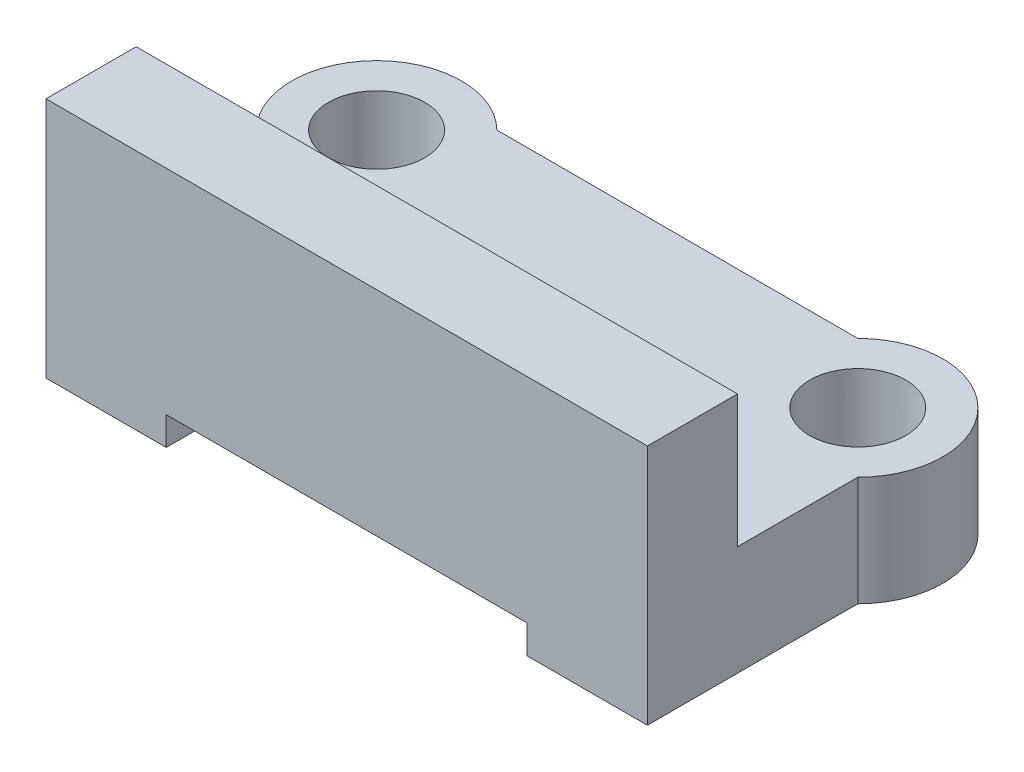
ISO-10303-21;
HEADER;
FILE_DESCRIPTION(('STEP AP214'),'2;1');
FILE_NAME('part.step','',(''),(''),'','','');
FILE_SCHEMA(('AUTOMOTIVE_DESIGN { 1 0 10303 214 1 1 1 1 }'));
ENDSEC;
DATA;
#1=APPLICATION_CONTEXT('core data for automotive mechanical design processes');
#2=APPLICATION_PROTOCOL_DEFINITION('international standard','automotive_design',2000,#1);
#3=PRODUCT_CONTEXT('',#1,'mechanical');
#4=PRODUCT('Part','Part','',(#3));
#5=PRODUCT_RELATED_PRODUCT_CATEGORY('part','',(#4));
#6=PRODUCT_DEFINITION_FORMATION('','',#4);
#7=PRODUCT_DEFINITION_CONTEXT('part definition',#1,'design');
#8=PRODUCT_DEFINITION('design','',#6,#7);
#9=PRODUCT_DEFINITION_SHAPE('','',#8);
#10=(LENGTH_UNIT() NAMED_UNIT(*) SI_UNIT(.MILLI.,.METRE.));
#11=(NAMED_UNIT(*) PLANE_ANGLE_UNIT() SI_UNIT($,.RADIAN.));
#12=(NAMED_UNIT(*) SI_UNIT($,.STERADIAN.) SOLID_ANGLE_UNIT());
#13=UNCERTAINTY_MEASURE_WITH_UNIT(LENGTH_MEASURE(1.E-05),#10,'distance_accuracy_value','');
#14=(GEOMETRIC_REPRESENTATION_CONTEXT(3) GLOBAL_UNCERTAINTY_ASSIGNED_CONTEXT((#13)) GLOBAL_UNIT_ASSIGNED_CONTEXT((#10,
#11,#12)) REPRESENTATION_CONTEXT('',''));
#15=CARTESIAN_POINT('',(0.,0.,0.));
#16=DIRECTION('',(0.,0.,1.));
#17=DIRECTION('',(1.,0.,0.));
#18=AXIS2_PLACEMENT_3D('',#15,#16,#17);
#19=CARTESIAN_POINT('',(0.,0.,0.));
#20=DIRECTION('',(0.,0.,1.));
#21=DIRECTION('',(1.,0.,0.));
#22=AXIS2_PLACEMENT_3D('',#19,#20,#21);
#23=PLANE('',#22);
#24=DIRECTION('',(1.,0.,0.));
#25=VECTOR('',#24,1.);
#26=CARTESIAN_POINT('',(40.6261390455604,-82.2027077511568,0.));
#27=LINE('',#26,#25);
#28=CARTESIAN_POINT('',(20.6185390455604,-82.2027077511568,0.));
#29=VERTEX_POINT('',#28);
#30=CARTESIAN_POINT('',(40.6261390455604,-82.2027077511568,0.));
#31=VERTEX_POINT('',#30);
#32=EDGE_CURVE('E185',#29,#31,#27,.T.);
#33=ORIENTED_EDGE('',*,*,#32,.F.);
#34=DIRECTION('',(0.,-1.,0.));
#35=VECTOR('',#34,1.);
#36=CARTESIAN_POINT('',(20.6185390455604,-73.2027077643161,0.));
#37=LINE('',#36,#35);
#38=CARTESIAN_POINT('',(20.6185390455604,-77.8027077487986,0.));
#39=VERTEX_POINT('',#38);
#40=EDGE_CURVE('E143',#39,#29,#37,.T.);
#41=ORIENTED_EDGE('',*,*,#40,.F.);
#42=DIRECTION('',(1.,0.,0.));
#43=VECTOR('',#42,1.);
#44=CARTESIAN_POINT('',(12.1261390455604,-77.8027077511569,0.));
#45=LINE('',#44,#43);
#46=CARTESIAN_POINT('',(40.6261390455604,-77.8027077487986,0.));
#47=VERTEX_POINT('',#46);
#48=EDGE_CURVE('E207',#39,#47,#45,.T.);
#49=ORIENTED_EDGE('',*,*,#48,.T.);
#50=DIRECTION('',(0.,1.,0.));
#51=VECTOR('',#50,1.);
#52=CARTESIAN_POINT('',(40.6261390455604,-85.8498182715212,0.));
#53=LINE('',#52,#51);
#54=EDGE_CURVE('E38',#31,#47,#53,.T.);
#55=ORIENTED_EDGE('',*,*,#54,.F.);
#56=EDGE_LOOP('',(#33,#41,#49,#55));
#57=FACE_BOUND('',#56,.T.);
#58=ADVANCED_FACE('F34',(#57),#23,.F.);
#59=CARTESIAN_POINT('',(36.6261390455604,-85.8498182715212,3.));
#60=DIRECTION('',(0.,1.,0.));
#61=DIRECTION('',(0.,0.,1.));
#62=AXIS2_PLACEMENT_3D('',#59,#60,#61);
#63=PLANE('',#62);
#64=CARTESIAN_POINT('',(38.6261390455604,-85.8498182715212,-6.00000000000001));
#65=DIRECTION('',(0.,1.,0.));
#66=DIRECTION('',(0.,0.,1.));
#67=AXIS2_PLACEMENT_3D('',#64,#65,#66);
#68=CIRCLE('',#67,1.6);
#69=CARTESIAN_POINT('',(38.6261390455604,-85.8498182715212,-4.40000000000001));
#70=VERTEX_POINT('',#69);
#71=EDGE_CURVE('E218',#70,#70,#68,.T.);
#72=ORIENTED_EDGE('',*,*,#71,.T.);
#73=EDGE_LOOP('',(#72));
#74=FACE_BOUND('',#73,.T.);
#75=DIRECTION('',(0.,0.,-1.));
#76=VECTOR('',#75,1.);
#77=CARTESIAN_POINT('',(36.6261390455604,-85.8498182715212,3.));
#78=LINE('',#77,#76);
#79=CARTESIAN_POINT('',(36.6261390455604,-85.8498182715212,3.));
#80=VERTEX_POINT('',#79);
#81=CARTESIAN_POINT('',(36.6261390455604,-85.8498182715212,-8.));
#82=VERTEX_POINT('',#81);
#83=EDGE_CURVE('E153',#80,#82,#78,.T.);
#84=ORIENTED_EDGE('',*,*,#83,.T.);
#85=CARTESIAN_POINT('',(38.6261390455604,-85.8498182715212,-6.00000000000001));
#86=DIRECTION('',(0.,-1.,0.));
#87=DIRECTION('',(0.,0.,-1.));
#88=AXIS2_PLACEMENT_3D('',#85,#86,#87);
#89=CIRCLE('',#88,2.82842712474619);
#90=CARTESIAN_POINT('',(40.6261390455604,-85.8498182715212,-4.00000000000001));
#91=VERTEX_POINT('',#90);
#92=EDGE_CURVE('E177',#82,#91,#89,.T.);
#93=ORIENTED_EDGE('',*,*,#92,.T.);
#94=DIRECTION('',(0.,0.,-1.));
#95=VECTOR('',#94,1.);
#96=CARTESIAN_POINT('',(40.6261390455604,-85.8498182715212,3.));
#97=LINE('',#96,#95);
#98=CARTESIAN_POINT('',(40.6261390455604,-85.8498182715212,3.));
#99=VERTEX_POINT('',#98);
#100=EDGE_CURVE('E11',#99,#91,#97,.T.);
#101=ORIENTED_EDGE('',*,*,#100,.F.);
#102=DIRECTION('',(1.,0.,0.));
#103=VECTOR('',#102,1.);
#104=CARTESIAN_POINT('',(36.6261390455604,-85.8498182715212,3.));
#105=LINE('',#104,#103);
#106=EDGE_CURVE('E137',#80,#99,#105,.T.);
#107=ORIENTED_EDGE('',*,*,#106,.F.);
#108=EDGE_LOOP('',(#84,#93,#101,#107));
#109=FACE_BOUND('',#108,.T.);
#110=ADVANCED_FACE('F36',(#74,#109),#63,.F.);
#111=CARTESIAN_POINT('',(40.6261390455604,-85.8498182715212,3.));
#112=DIRECTION('',(-1.,0.,0.));
#113=DIRECTION('',(0.,0.,1.));
#114=AXIS2_PLACEMENT_3D('',#111,#112,#113);
#115=PLANE('',#114);
#116=ORIENTED_EDGE('',*,*,#54,.T.);
#117=DIRECTION('',(0.,0.,1.));
#118=VECTOR('',#117,1.);
#119=CARTESIAN_POINT('',(40.6261390455604,-77.8027077487986,3.));
#120=LINE('',#119,#118);
#121=CARTESIAN_POINT('',(40.6261390455604,-77.8027077487986,3.));
#122=VERTEX_POINT('',#121);
#123=EDGE_CURVE('E121',#47,#122,#120,.T.);
#124=ORIENTED_EDGE('',*,*,#123,.T.);
#125=DIRECTION('',(0.,1.,0.));
#126=VECTOR('',#125,1.);
#127=CARTESIAN_POINT('',(40.6261390455604,-85.8498182715212,3.));
#128=LINE('',#127,#126);
#129=EDGE_CURVE('E129',#99,#122,#128,.T.);
#130=ORIENTED_EDGE('',*,*,#129,.F.);
#131=ORIENTED_EDGE('',*,*,#100,.T.);
#132=DIRECTION('',(0.,-1.,0.));
#133=VECTOR('',#132,1.);
#134=CARTESIAN_POINT('',(40.6261390455604,-78.1178220121165,-4.00000000000001));
#135=LINE('',#134,#133);
#136=CARTESIAN_POINT('',(40.6261390455604,-82.2027077511568,-4.00000000000001));
#137=VERTEX_POINT('',#136);
#138=EDGE_CURVE('E133',#137,#91,#135,.T.);
#139=ORIENTED_EDGE('',*,*,#138,.F.);
#140=DIRECTION('',(0.,0.,1.));
#141=VECTOR('',#140,1.);
#142=CARTESIAN_POINT('',(40.6261390455604,-82.2027077511568,-8.));
#143=LINE('',#142,#141);
#144=EDGE_CURVE('E227',#137,#31,#143,.T.);
#145=ORIENTED_EDGE('',*,*,#144,.T.);
#146=EDGE_LOOP('',(#116,#124,#130,#131,#139,#145));
#147=FACE_BOUND('',#146,.T.);
#148=ADVANCED_FACE('F128',(#147),#115,.F.);
#149=CARTESIAN_POINT('',(20.6185390455604,-73.2027077643161,3.));
#150=DIRECTION('',(1.,0.,0.));
#151=DIRECTION('',(0.,1.,0.));
#152=AXIS2_PLACEMENT_3D('',#149,#150,#151);
#153=PLANE('',#152);
#154=DIRECTION('',(0.,-1.,0.));
#155=VECTOR('',#154,1.);
#156=CARTESIAN_POINT('',(20.6185390455604,-73.2027077643161,3.));
#157=LINE('',#156,#155);
#158=CARTESIAN_POINT('',(20.6185390455604,-77.8027077487986,3.));
#159=VERTEX_POINT('',#158);
#160=CARTESIAN_POINT('',(20.6185390455604,-85.8498182715212,3.));
#161=VERTEX_POINT('',#160);
#162=EDGE_CURVE('E139',#159,#161,#157,.T.);
#163=ORIENTED_EDGE('',*,*,#162,.F.);
#164=DIRECTION('',(0.,0.,-1.));
#165=VECTOR('',#164,1.);
#166=CARTESIAN_POINT('',(20.6185390455604,-77.8027077487986,3.));
#167=LINE('',#166,#165);
#168=EDGE_CURVE('E52',#159,#39,#167,.T.);
#169=ORIENTED_EDGE('',*,*,#168,.T.);
#170=ORIENTED_EDGE('',*,*,#40,.T.);
#171=DIRECTION('',(0.,0.,1.));
#172=VECTOR('',#171,1.);
#173=CARTESIAN_POINT('',(20.6185390455604,-82.2027077511568,-8.));
#174=LINE('',#173,#172);
#175=CARTESIAN_POINT('',(20.6185390455604,-82.2027077511568,-4.));
#176=VERTEX_POINT('',#175);
#177=EDGE_CURVE('E230',#176,#29,#174,.T.);
#178=ORIENTED_EDGE('',*,*,#177,.F.);
#179=DIRECTION('',(0.,-1.,0.));
#180=VECTOR('',#179,1.);
#181=CARTESIAN_POINT('',(20.6185390455604,-78.1178220121165,-4.));
#182=LINE('',#181,#180);
#183=CARTESIAN_POINT('',(20.6185390455604,-85.8498182715212,-4.));
#184=VERTEX_POINT('',#183);
#185=EDGE_CURVE('E202',#176,#184,#182,.T.);
#186=ORIENTED_EDGE('',*,*,#185,.T.);
#187=DIRECTION('',(0.,0.,-1.));
#188=VECTOR('',#187,1.);
#189=CARTESIAN_POINT('',(20.6185390455604,-85.8498182715212,3.));
#190=LINE('',#189,#188);
#191=EDGE_CURVE('E44',#161,#184,#190,.T.);
#192=ORIENTED_EDGE('',*,*,#191,.F.);
#193=EDGE_LOOP('',(#163,#169,#170,#178,#186,#192));
#194=FACE_BOUND('',#193,.T.);
#195=ADVANCED_FACE('F240',(#194),#153,.F.);
#196=CARTESIAN_POINT('',(20.6185390455604,-85.8498182715212,3.));
#197=DIRECTION('',(0.,1.,0.));
#198=DIRECTION('',(0.,0.,1.));
#199=AXIS2_PLACEMENT_3D('',#196,#197,#198);
#200=PLANE('',#199);
#201=CARTESIAN_POINT('',(22.6185390455604,-85.8498182715212,-6.));
#202=DIRECTION('',(0.,1.,0.));
#203=DIRECTION('',(0.,0.,1.));
#204=AXIS2_PLACEMENT_3D('',#201,#202,#203);
#205=CIRCLE('',#204,1.6);
#206=CARTESIAN_POINT('',(22.6185390455604,-85.8498182715212,-4.4));
#207=VERTEX_POINT('',#206);
#208=EDGE_CURVE('E212',#207,#207,#205,.T.);
#209=ORIENTED_EDGE('',*,*,#208,.T.);
#210=EDGE_LOOP('',(#209));
#211=FACE_BOUND('',#210,.T.);
#212=ORIENTED_EDGE('',*,*,#191,.T.);
#213=CARTESIAN_POINT('',(22.6185390455604,-85.8498182715212,-6.));
#214=DIRECTION('',(0.,-1.,0.));
#215=DIRECTION('',(0.,0.,-1.));
#216=AXIS2_PLACEMENT_3D('',#213,#214,#215);
#217=CIRCLE('',#216,2.82842712474619);
#218=CARTESIAN_POINT('',(24.6185390455604,-85.8498182715212,-8.));
#219=VERTEX_POINT('',#218);
#220=EDGE_CURVE('E200',#184,#219,#217,.T.);
#221=ORIENTED_EDGE('',*,*,#220,.T.);
#222=DIRECTION('',(0.,0.,-1.));
#223=VECTOR('',#222,1.);
#224=CARTESIAN_POINT('',(24.6185390455604,-85.8498182715212,3.));
#225=LINE('',#224,#223);
#226=CARTESIAN_POINT('',(24.6185390455604,-85.8498182715212,3.));
#227=VERTEX_POINT('',#226);
#228=EDGE_CURVE('E163',#227,#219,#225,.T.);
#229=ORIENTED_EDGE('',*,*,#228,.F.);
#230=DIRECTION('',(1.,0.,0.));
#231=VECTOR('',#230,1.);
#232=CARTESIAN_POINT('',(20.6185390455604,-85.8498182715212,3.));
#233=LINE('',#232,#231);
#234=EDGE_CURVE('E141',#161,#227,#233,.T.);
#235=ORIENTED_EDGE('',*,*,#234,.F.);
#236=EDGE_LOOP('',(#212,#221,#229,#235));
#237=FACE_BOUND('',#236,.T.);
#238=ADVANCED_FACE('F247',(#211,#237),#200,.F.);
#239=CARTESIAN_POINT('',(24.6185390455604,-84.9027077644928,3.));
#240=DIRECTION('',(-1.,0.,0.));
#241=DIRECTION('',(0.,-1.,0.));
#242=AXIS2_PLACEMENT_3D('',#239,#240,#241);
#243=PLANE('',#242);
#244=ORIENTED_EDGE('',*,*,#228,.T.);
#245=DIRECTION('',(0.,-1.,0.));
#246=VECTOR('',#245,1.);
#247=CARTESIAN_POINT('',(24.6185390455604,-84.9027077644928,-8.));
#248=LINE('',#247,#246);
#249=CARTESIAN_POINT('',(24.6185390455604,-84.9027077644928,-8.));
#250=VERTEX_POINT('',#249);
#251=EDGE_CURVE('E223',#250,#219,#248,.T.);
#252=ORIENTED_EDGE('',*,*,#251,.F.);
#253=DIRECTION('',(0.,0.,-1.));
#254=VECTOR('',#253,1.);
#255=CARTESIAN_POINT('',(24.6185390455604,-84.9027077644928,3.));
#256=LINE('',#255,#254);
#257=CARTESIAN_POINT('',(24.6185390455604,-84.9027077644928,3.));
#258=VERTEX_POINT('',#257);
#259=EDGE_CURVE('E166',#258,#250,#256,.T.);
#260=ORIENTED_EDGE('',*,*,#259,.F.);
#261=DIRECTION('',(0.,1.,0.));
#262=VECTOR('',#261,1.);
#263=CARTESIAN_POINT('',(24.6185390455604,-84.9027077644928,3.));
#264=LINE('',#263,#262);
#265=EDGE_CURVE('E148',#227,#258,#264,.T.);
#266=ORIENTED_EDGE('',*,*,#265,.F.);
#267=EDGE_LOOP('',(#244,#252,#260,#266));
#268=FACE_BOUND('',#267,.T.);
#269=ADVANCED_FACE('F250',(#268),#243,.F.);
#270=CARTESIAN_POINT('',(36.6261390455604,-84.9027077644928,3.));
#271=DIRECTION('',(0.,1.,0.));
#272=DIRECTION('',(0.,0.,1.));
#273=AXIS2_PLACEMENT_3D('',#270,#271,#272);
#274=PLANE('',#273);
#275=ORIENTED_EDGE('',*,*,#259,.T.);
#276=DIRECTION('',(-1.,0.,0.));
#277=VECTOR('',#276,1.);
#278=CARTESIAN_POINT('',(36.6261390455604,-84.9027077644928,-8.));
#279=LINE('',#278,#277);
#280=CARTESIAN_POINT('',(36.6261390455604,-84.9027077644928,-8.));
#281=VERTEX_POINT('',#280);
#282=EDGE_CURVE('E184',#281,#250,#279,.T.);
#283=ORIENTED_EDGE('',*,*,#282,.F.);
#284=DIRECTION('',(0.,0.,-1.));
#285=VECTOR('',#284,1.);
#286=CARTESIAN_POINT('',(36.6261390455604,-84.9027077644928,3.));
#287=LINE('',#286,#285);
#288=CARTESIAN_POINT('',(36.6261390455604,-84.9027077644928,3.));
#289=VERTEX_POINT('',#288);
#290=EDGE_CURVE('E167',#289,#281,#287,.T.);
#291=ORIENTED_EDGE('',*,*,#290,.F.);
#292=DIRECTION('',(1.,0.,0.));
#293=VECTOR('',#292,1.);
#294=CARTESIAN_POINT('',(36.6261390455604,-84.9027077644928,3.));
#295=LINE('',#294,#293);
#296=EDGE_CURVE('E150',#258,#289,#295,.T.);
#297=ORIENTED_EDGE('',*,*,#296,.F.);
#298=EDGE_LOOP('',(#275,#283,#291,#297));
#299=FACE_BOUND('',#298,.T.);
#300=ADVANCED_FACE('F253',(#299),#274,.F.);
#301=CARTESIAN_POINT('',(36.6261390455604,-85.8498182715212,3.));
#302=DIRECTION('',(1.,0.,0.));
#303=DIRECTION('',(0.,0.,-1.));
#304=AXIS2_PLACEMENT_3D('',#301,#302,#303);
#305=PLANE('',#304);
#306=ORIENTED_EDGE('',*,*,#290,.T.);
#307=DIRECTION('',(0.,1.,0.));
#308=VECTOR('',#307,1.);
#309=CARTESIAN_POINT('',(36.6261390455604,-85.8498182715212,-8.));
#310=LINE('',#309,#308);
#311=EDGE_CURVE('E180',#82,#281,#310,.T.);
#312=ORIENTED_EDGE('',*,*,#311,.F.);
#313=ORIENTED_EDGE('',*,*,#83,.F.);
#314=DIRECTION('',(0.,-1.,0.));
#315=VECTOR('',#314,1.);
#316=CARTESIAN_POINT('',(36.6261390455604,-85.8498182715212,3.));
#317=LINE('',#316,#315);
#318=EDGE_CURVE('E152',#289,#80,#317,.T.);
#319=ORIENTED_EDGE('',*,*,#318,.F.);
#320=EDGE_LOOP('',(#306,#312,#313,#319));
#321=FACE_BOUND('',#320,.T.);
#322=ADVANCED_FACE('F181',(#321),#305,.F.);
#323=CARTESIAN_POINT('',(0.,0.,3.));
#324=DIRECTION('',(0.,0.,1.));
#325=DIRECTION('',(1.,0.,0.));
#326=AXIS2_PLACEMENT_3D('',#323,#324,#325);
#327=PLANE('',#326);
#328=DIRECTION('',(1.,0.,0.));
#329=VECTOR('',#328,1.);
#330=CARTESIAN_POINT('',(17.0108981684617,-77.8027077487986,3.));
#331=LINE('',#330,#329);
#332=EDGE_CURVE('E118',#159,#122,#331,.T.);
#333=ORIENTED_EDGE('',*,*,#332,.F.);
#334=ORIENTED_EDGE('',*,*,#162,.T.);
#335=ORIENTED_EDGE('',*,*,#234,.T.);
#336=ORIENTED_EDGE('',*,*,#265,.T.);
#337=ORIENTED_EDGE('',*,*,#296,.T.);
#338=ORIENTED_EDGE('',*,*,#318,.T.);
#339=ORIENTED_EDGE('',*,*,#106,.T.);
#340=ORIENTED_EDGE('',*,*,#129,.T.);
#341=EDGE_LOOP('',(#333,#334,#335,#336,#337,#338,#339,#340));
#342=FACE_BOUND('',#341,.T.);
#343=ADVANCED_FACE('F135',(#342),#327,.T.);
#344=CARTESIAN_POINT('',(40.6261390455604,-82.2027077511568,-8.));
#345=DIRECTION('',(0.,-1.,0.));
#346=DIRECTION('',(0.,0.,-1.));
#347=AXIS2_PLACEMENT_3D('',#344,#345,#346);
#348=PLANE('',#347);
#349=CARTESIAN_POINT('',(22.6185390455604,-82.2027077511568,-6.));
#350=DIRECTION('',(0.,-1.,0.));
#351=DIRECTION('',(0.,0.,-1.));
#352=AXIS2_PLACEMENT_3D('',#349,#350,#351);
#353=CIRCLE('',#352,1.6);
#354=CARTESIAN_POINT('',(22.6185390455604,-82.2027077511568,-7.6));
#355=VERTEX_POINT('',#354);
#356=EDGE_CURVE('E209',#355,#355,#353,.T.);
#357=ORIENTED_EDGE('',*,*,#356,.T.);
#358=EDGE_LOOP('',(#357));
#359=FACE_BOUND('',#358,.T.);
#360=CARTESIAN_POINT('',(38.6261390455604,-82.2027077511568,-6.00000000000001));
#361=DIRECTION('',(0.,-1.,0.));
#362=DIRECTION('',(0.,0.,-1.));
#363=AXIS2_PLACEMENT_3D('',#360,#361,#362);
#364=CIRCLE('',#363,1.6);
#365=CARTESIAN_POINT('',(38.6261390455604,-82.2027077511568,-7.6));
#366=VERTEX_POINT('',#365);
#367=EDGE_CURVE('E215',#366,#366,#364,.T.);
#368=ORIENTED_EDGE('',*,*,#367,.T.);
#369=EDGE_LOOP('',(#368));
#370=FACE_BOUND('',#369,.T.);
#371=ORIENTED_EDGE('',*,*,#32,.T.);
#372=ORIENTED_EDGE('',*,*,#144,.F.);
#373=CARTESIAN_POINT('',(38.6261390455604,-82.2027077511568,-6.00000000000001));
#374=DIRECTION('',(0.,-1.,0.));
#375=DIRECTION('',(0.,0.,-1.));
#376=AXIS2_PLACEMENT_3D('',#373,#374,#375);
#377=CIRCLE('',#376,2.82842712474619);
#378=CARTESIAN_POINT('',(36.6261390455604,-82.2027077511568,-8.));
#379=VERTEX_POINT('',#378);
#380=EDGE_CURVE('E191',#137,#379,#377,.F.);
#381=ORIENTED_EDGE('',*,*,#380,.T.);
#382=DIRECTION('',(1.,0.,0.));
#383=VECTOR('',#382,1.);
#384=CARTESIAN_POINT('',(40.6261390455604,-82.2027077511568,-8.));
#385=LINE('',#384,#383);
#386=CARTESIAN_POINT('',(24.6185390455604,-82.2027077511568,-8.));
#387=VERTEX_POINT('',#386);
#388=EDGE_CURVE('E60',#387,#379,#385,.T.);
#389=ORIENTED_EDGE('',*,*,#388,.F.);
#390=CARTESIAN_POINT('',(22.6185390455604,-82.2027077511568,-6.));
#391=DIRECTION('',(0.,-1.,0.));
#392=DIRECTION('',(0.,0.,-1.));
#393=AXIS2_PLACEMENT_3D('',#390,#391,#392);
#394=CIRCLE('',#393,2.82842712474619);
#395=EDGE_CURVE('E205',#387,#176,#394,.F.);
#396=ORIENTED_EDGE('',*,*,#395,.T.);
#397=ORIENTED_EDGE('',*,*,#177,.T.);
#398=EDGE_LOOP('',(#371,#372,#381,#389,#396,#397));
#399=FACE_BOUND('',#398,.T.);
#400=ADVANCED_FACE('F234',(#359,#370,#399),#348,.F.);
#401=CARTESIAN_POINT('',(0.,0.,-8.));
#402=DIRECTION('',(0.,0.,-1.));
#403=DIRECTION('',(-1.,0.,0.));
#404=AXIS2_PLACEMENT_3D('',#401,#402,#403);
#405=PLANE('',#404);
#406=DIRECTION('',(0.,-1.,0.));
#407=VECTOR('',#406,1.);
#408=CARTESIAN_POINT('',(36.6261390455604,-78.1178220121165,-8.00000000000001));
#409=LINE('',#408,#407);
#410=EDGE_CURVE('E189',#379,#281,#409,.T.);
#411=ORIENTED_EDGE('',*,*,#410,.T.);
#412=ORIENTED_EDGE('',*,*,#282,.T.);
#413=DIRECTION('',(0.,-1.,0.));
#414=VECTOR('',#413,1.);
#415=CARTESIAN_POINT('',(24.6185390455604,-78.1178220121165,-8.));
#416=LINE('',#415,#414);
#417=EDGE_CURVE('E197',#387,#250,#416,.T.);
#418=ORIENTED_EDGE('',*,*,#417,.F.);
#419=ORIENTED_EDGE('',*,*,#388,.T.);
#420=EDGE_LOOP('',(#411,#412,#418,#419));
#421=FACE_BOUND('',#420,.T.);
#422=ADVANCED_FACE('F254',(#421),#405,.T.);
#423=CARTESIAN_POINT('',(38.6261390455604,-73.2027077643161,-6.00000000000001));
#424=DIRECTION('',(0.,1.,0.));
#425=DIRECTION('',(0.,0.,1.));
#426=AXIS2_PLACEMENT_3D('',#423,#424,#425);
#427=CYLINDRICAL_SURFACE('',#426,1.6);
#428=ORIENTED_EDGE('',*,*,#367,.F.);
#429=EDGE_LOOP('',(#428));
#430=FACE_BOUND('',#429,.T.);
#431=ORIENTED_EDGE('',*,*,#71,.F.);
#432=EDGE_LOOP('',(#431));
#433=FACE_BOUND('',#432,.T.);
#434=ADVANCED_FACE('F265',(#430,#433),#427,.F.);
#435=CARTESIAN_POINT('',(22.6185390455604,-73.2027077643161,-6.));
#436=DIRECTION('',(0.,1.,0.));
#437=DIRECTION('',(0.,0.,1.));
#438=AXIS2_PLACEMENT_3D('',#435,#436,#437);
#439=CYLINDRICAL_SURFACE('',#438,1.6);
#440=ORIENTED_EDGE('',*,*,#356,.F.);
#441=EDGE_LOOP('',(#440));
#442=FACE_BOUND('',#441,.T.);
#443=ORIENTED_EDGE('',*,*,#208,.F.);
#444=EDGE_LOOP('',(#443));
#445=FACE_BOUND('',#444,.T.);
#446=ADVANCED_FACE('F258',(#442,#445),#439,.F.);
#447=CARTESIAN_POINT('',(22.6185390455604,-78.1178220121165,-6.));
#448=DIRECTION('',(0.,-1.,0.));
#449=DIRECTION('',(0.,0.,-1.));
#450=AXIS2_PLACEMENT_3D('',#447,#448,#449);
#451=CYLINDRICAL_SURFACE('',#450,2.82842712474619);
#452=ORIENTED_EDGE('',*,*,#395,.F.);
#453=ORIENTED_EDGE('',*,*,#417,.T.);
#454=ORIENTED_EDGE('',*,*,#251,.T.);
#455=ORIENTED_EDGE('',*,*,#220,.F.);
#456=ORIENTED_EDGE('',*,*,#185,.F.);
#457=EDGE_LOOP('',(#452,#453,#454,#455,#456));
#458=FACE_BOUND('',#457,.T.);
#459=ADVANCED_FACE('F256',(#458),#451,.T.);
#460=CARTESIAN_POINT('',(38.6261390455604,-78.1178220121165,-6.00000000000001));
#461=DIRECTION('',(0.,-1.,0.));
#462=DIRECTION('',(0.,0.,-1.));
#463=AXIS2_PLACEMENT_3D('',#460,#461,#462);
#464=CYLINDRICAL_SURFACE('',#463,2.82842712474619);
#465=ORIENTED_EDGE('',*,*,#380,.F.);
#466=ORIENTED_EDGE('',*,*,#138,.T.);
#467=ORIENTED_EDGE('',*,*,#92,.F.);
#468=ORIENTED_EDGE('',*,*,#311,.T.);
#469=ORIENTED_EDGE('',*,*,#410,.F.);
#470=EDGE_LOOP('',(#465,#466,#467,#468,#469));
#471=FACE_BOUND('',#470,.T.);
#472=ADVANCED_FACE('F187',(#471),#464,.T.);
#473=CARTESIAN_POINT('',(17.0108981684617,-77.8027077487986,-12.));
#474=DIRECTION('',(0.,-1.,0.));
#475=DIRECTION('',(0.,0.,-1.));
#476=AXIS2_PLACEMENT_3D('',#473,#474,#475);
#477=PLANE('',#476);
#478=ORIENTED_EDGE('',*,*,#48,.F.);
#479=ORIENTED_EDGE('',*,*,#168,.F.);
#480=ORIENTED_EDGE('',*,*,#332,.T.);
#481=ORIENTED_EDGE('',*,*,#123,.F.);
#482=EDGE_LOOP('',(#478,#479,#480,#481));
#483=FACE_BOUND('',#482,.T.);
#484=ADVANCED_FACE('F120',(#483),#477,.F.);
#485=CLOSED_SHELL('',(#58,#110,#148,#195,#238,#269,#300,#322,#343,#400,#422,#434,#446,#459,#472,#484));
#486=MANIFOLD_SOLID_BREP('B2',#485);
#487=ADVANCED_BREP_SHAPE_REPRESENTATION('',(#18,#486),#14);
#488=SHAPE_DEFINITION_REPRESENTATION(#9,#487);
ENDSEC;
END-ISO-10303-21;
